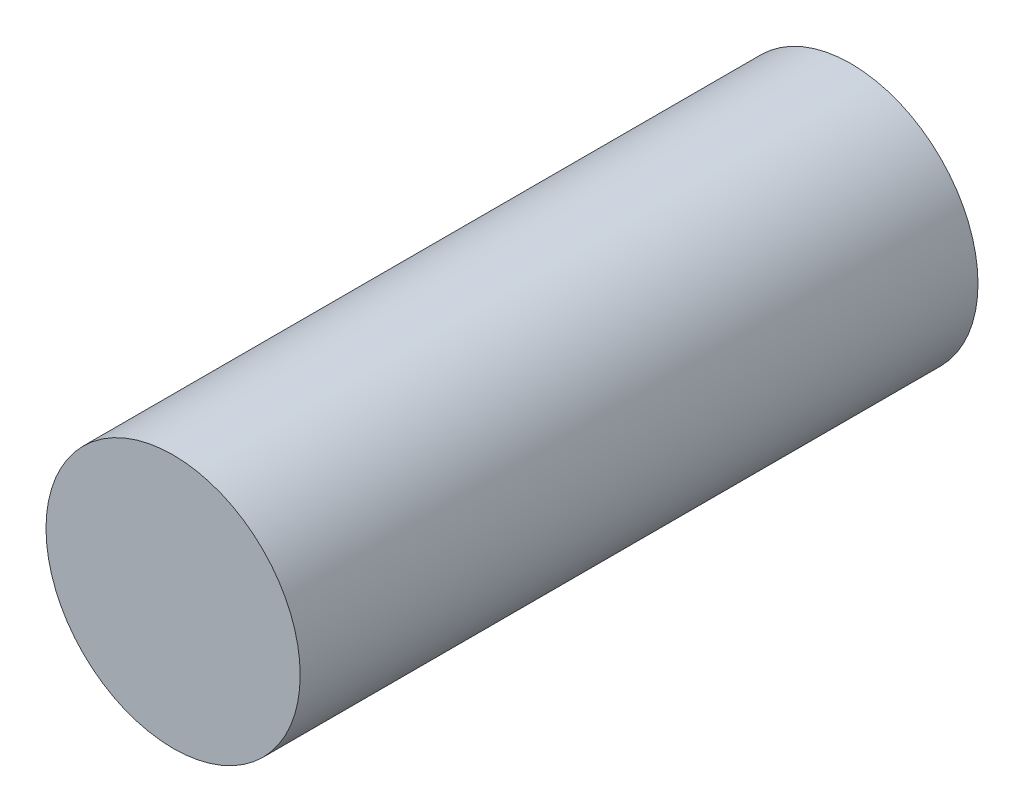
ISO-10303-21;
HEADER;
FILE_DESCRIPTION(('STEP AP214'),'2;1');
FILE_NAME('part.step','',(''),(''),'','','');
FILE_SCHEMA(('AUTOMOTIVE_DESIGN { 1 0 10303 214 1 1 1 1 }'));
ENDSEC;
DATA;
#1=APPLICATION_CONTEXT('core data for automotive mechanical design processes');
#2=APPLICATION_PROTOCOL_DEFINITION('international standard','automotive_design',2000,#1);
#3=PRODUCT_CONTEXT('',#1,'mechanical');
#4=PRODUCT('Part','Part','',(#3));
#5=PRODUCT_RELATED_PRODUCT_CATEGORY('part','',(#4));
#6=PRODUCT_DEFINITION_FORMATION('','',#4);
#7=PRODUCT_DEFINITION_CONTEXT('part definition',#1,'design');
#8=PRODUCT_DEFINITION('design','',#6,#7);
#9=PRODUCT_DEFINITION_SHAPE('','',#8);
#10=(LENGTH_UNIT() NAMED_UNIT(*) SI_UNIT(.MILLI.,.METRE.));
#11=(NAMED_UNIT(*) PLANE_ANGLE_UNIT() SI_UNIT($,.RADIAN.));
#12=(NAMED_UNIT(*) SI_UNIT($,.STERADIAN.) SOLID_ANGLE_UNIT());
#13=UNCERTAINTY_MEASURE_WITH_UNIT(LENGTH_MEASURE(1.E-05),#10,'distance_accuracy_value','');
#14=(GEOMETRIC_REPRESENTATION_CONTEXT(3) GLOBAL_UNCERTAINTY_ASSIGNED_CONTEXT((#13)) GLOBAL_UNIT_ASSIGNED_CONTEXT((#10,
#11,#12)) REPRESENTATION_CONTEXT('',''));
#15=CARTESIAN_POINT('',(0.,0.,0.));
#16=DIRECTION('',(0.,0.,1.));
#17=DIRECTION('',(1.,0.,0.));
#18=AXIS2_PLACEMENT_3D('',#15,#16,#17);
#19=CARTESIAN_POINT('',(0.,0.,25.4));
#20=DIRECTION('',(0.,0.,-1.));
#21=DIRECTION('',(-1.,0.,0.));
#22=AXIS2_PLACEMENT_3D('',#19,#20,#21);
#23=CYLINDRICAL_SURFACE('',#22,4.7625);
#24=CARTESIAN_POINT('',(0.,0.,25.4));
#25=DIRECTION('',(0.,0.,1.));
#26=DIRECTION('',(1.,0.,0.));
#27=AXIS2_PLACEMENT_3D('',#24,#25,#26);
#28=CIRCLE('',#27,4.7625);
#29=CARTESIAN_POINT('',(4.7625,0.,25.4));
#30=VERTEX_POINT('',#29);
#31=EDGE_CURVE('E10',#30,#30,#28,.T.);
#32=ORIENTED_EDGE('',*,*,#31,.F.);
#33=EDGE_LOOP('',(#32));
#34=FACE_BOUND('',#33,.T.);
#35=CARTESIAN_POINT('',(0.,0.,0.));
#36=DIRECTION('',(0.,0.,1.));
#37=DIRECTION('',(1.,0.,0.));
#38=AXIS2_PLACEMENT_3D('',#35,#36,#37);
#39=CIRCLE('',#38,4.7625);
#40=CARTESIAN_POINT('',(4.7625,0.,0.));
#41=VERTEX_POINT('',#40);
#42=EDGE_CURVE('E35',#41,#41,#39,.T.);
#43=ORIENTED_EDGE('',*,*,#42,.T.);
#44=EDGE_LOOP('',(#43));
#45=FACE_BOUND('',#44,.T.);
#46=ADVANCED_FACE('F32',(#34,#45),#23,.T.);
#47=CARTESIAN_POINT('',(0.,0.,25.4));
#48=DIRECTION('',(0.,0.,1.));
#49=DIRECTION('',(1.,0.,0.));
#50=AXIS2_PLACEMENT_3D('',#47,#48,#49);
#51=PLANE('',#50);
#52=ORIENTED_EDGE('',*,*,#31,.T.);
#53=EDGE_LOOP('',(#52));
#54=FACE_BOUND('',#53,.T.);
#55=ADVANCED_FACE('F47',(#54),#51,.T.);
#56=CARTESIAN_POINT('',(0.,0.,0.));
#57=DIRECTION('',(0.,0.,1.));
#58=DIRECTION('',(1.,0.,0.));
#59=AXIS2_PLACEMENT_3D('',#56,#57,#58);
#60=PLANE('',#59);
#61=ORIENTED_EDGE('',*,*,#42,.F.);
#62=EDGE_LOOP('',(#61));
#63=FACE_BOUND('',#62,.T.);
#64=ADVANCED_FACE('F45',(#63),#60,.F.);
#65=CLOSED_SHELL('',(#46,#55,#64));
#66=MANIFOLD_SOLID_BREP('B2',#65);
#67=ADVANCED_BREP_SHAPE_REPRESENTATION('',(#18,#66),#14);
#68=SHAPE_DEFINITION_REPRESENTATION(#9,#67);
ENDSEC;
END-ISO-10303-21;
